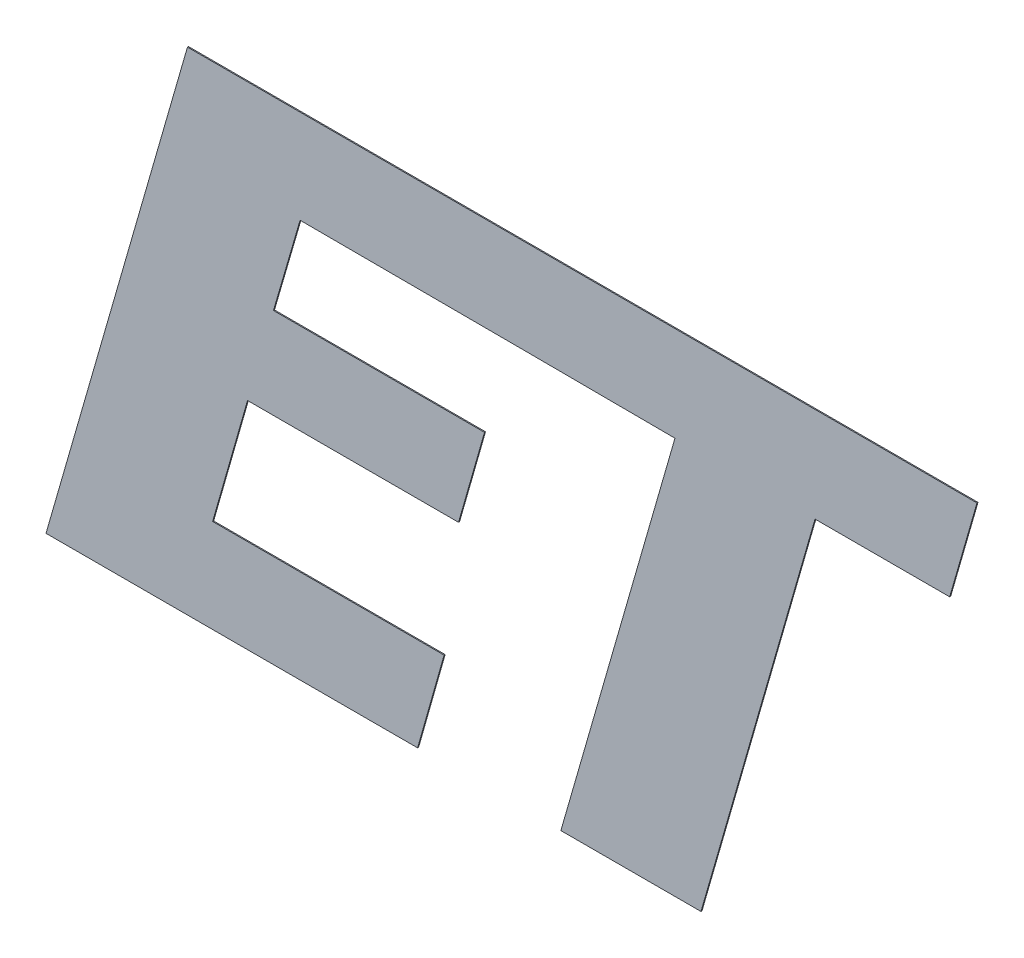
ISO-10303-21;
HEADER;
FILE_DESCRIPTION(('STEP AP214'),'2;1');
FILE_NAME('part.step','',(''),(''),'','','');
FILE_SCHEMA(('AUTOMOTIVE_DESIGN { 1 0 10303 214 1 1 1 1 }'));
ENDSEC;
DATA;
#1=APPLICATION_CONTEXT('core data for automotive mechanical design processes');
#2=APPLICATION_PROTOCOL_DEFINITION('international standard','automotive_design',2000,#1);
#3=PRODUCT_CONTEXT('',#1,'mechanical');
#4=PRODUCT('Part','Part','',(#3));
#5=PRODUCT_RELATED_PRODUCT_CATEGORY('part','',(#4));
#6=PRODUCT_DEFINITION_FORMATION('','',#4);
#7=PRODUCT_DEFINITION_CONTEXT('part definition',#1,'design');
#8=PRODUCT_DEFINITION('design','',#6,#7);
#9=PRODUCT_DEFINITION_SHAPE('','',#8);
#10=(LENGTH_UNIT() NAMED_UNIT(*) SI_UNIT(.MILLI.,.METRE.));
#11=(NAMED_UNIT(*) PLANE_ANGLE_UNIT() SI_UNIT($,.RADIAN.));
#12=(NAMED_UNIT(*) SI_UNIT($,.STERADIAN.) SOLID_ANGLE_UNIT());
#13=UNCERTAINTY_MEASURE_WITH_UNIT(LENGTH_MEASURE(1.E-05),#10,'distance_accuracy_value','');
#14=(GEOMETRIC_REPRESENTATION_CONTEXT(3) GLOBAL_UNCERTAINTY_ASSIGNED_CONTEXT((#13)) GLOBAL_UNIT_ASSIGNED_CONTEXT((#10,
#11,#12)) REPRESENTATION_CONTEXT('',''));
#15=CARTESIAN_POINT('',(0.,0.,0.));
#16=DIRECTION('',(0.,0.,1.));
#17=DIRECTION('',(1.,0.,0.));
#18=AXIS2_PLACEMENT_3D('',#15,#16,#17);
#19=CARTESIAN_POINT('',(11.8438200911148,6.48178370243124,5.505));
#20=DIRECTION('',(0.00281330167602319,0.99999604265901,0.));
#21=DIRECTION('',(0.,0.,-1.));
#22=AXIS2_PLACEMENT_3D('',#19,#20,#21);
#23=PLANE('',#22);
#24=DIRECTION('',(0.99999604265901,-0.00281330167602319,0.));
#25=VECTOR('',#24,1.);
#26=CARTESIAN_POINT('',(11.8438200911148,6.48178370243124,5.5));
#27=LINE('',#26,#25);
#28=CARTESIAN_POINT('',(11.8438200911148,6.48178370243124,5.5));
#29=VERTEX_POINT('',#28);
#30=CARTESIAN_POINT('',(12.952515059986,6.47866459667375,5.5));
#31=VERTEX_POINT('',#30);
#32=EDGE_CURVE('E10',#29,#31,#27,.T.);
#33=ORIENTED_EDGE('',*,*,#32,.T.);
#34=DIRECTION('',(0.,0.,-1.));
#35=VECTOR('',#34,1.);
#36=CARTESIAN_POINT('',(12.952515059986,6.47866459667375,5.505));
#37=LINE('',#36,#35);
#38=CARTESIAN_POINT('',(12.952515059986,6.47866459667375,5.505));
#39=VERTEX_POINT('',#38);
#40=EDGE_CURVE('E42',#39,#31,#37,.T.);
#41=ORIENTED_EDGE('',*,*,#40,.F.);
#42=DIRECTION('',(0.99999604265901,-0.00281330167602319,0.));
#43=VECTOR('',#42,1.);
#44=CARTESIAN_POINT('',(11.8438200911148,6.48178370243124,5.505));
#45=LINE('',#44,#43);
#46=CARTESIAN_POINT('',(11.8438200911148,6.48178370243124,5.505));
#47=VERTEX_POINT('',#46);
#48=EDGE_CURVE('E261',#47,#39,#45,.T.);
#49=ORIENTED_EDGE('',*,*,#48,.F.);
#50=DIRECTION('',(0.,0.,-1.));
#51=VECTOR('',#50,1.);
#52=CARTESIAN_POINT('',(11.8438200911148,6.48178370243124,5.505));
#53=LINE('',#52,#51);
#54=EDGE_CURVE('E27',#47,#29,#53,.T.);
#55=ORIENTED_EDGE('',*,*,#54,.T.);
#56=EDGE_LOOP('',(#33,#41,#49,#55));
#57=FACE_BOUND('',#56,.T.);
#58=ADVANCED_FACE('F16',(#57),#23,.F.);
#59=CARTESIAN_POINT('',(12.952515059986,6.47866459667375,5.505));
#60=DIRECTION('',(0.00465069382367867,0.999989185465002,0.));
#61=DIRECTION('',(0.,0.,-1.));
#62=AXIS2_PLACEMENT_3D('',#59,#60,#61);
#63=PLANE('',#62);
#64=DIRECTION('',(0.999989185465002,-0.00465069382367867,0.));
#65=VECTOR('',#64,1.);
#66=CARTESIAN_POINT('',(12.952515059986,6.47866459667375,5.5));
#67=LINE('',#66,#65);
#68=CARTESIAN_POINT('',(13.6880355080419,6.47524387927532,5.5));
#69=VERTEX_POINT('',#68);
#70=EDGE_CURVE('E322',#31,#69,#67,.T.);
#71=ORIENTED_EDGE('',*,*,#70,.T.);
#72=DIRECTION('',(0.,0.,-1.));
#73=VECTOR('',#72,1.);
#74=CARTESIAN_POINT('',(13.6880355080419,6.47524387927532,5.505));
#75=LINE('',#74,#73);
#76=CARTESIAN_POINT('',(13.6880355080419,6.47524387927532,5.505));
#77=VERTEX_POINT('',#76);
#78=EDGE_CURVE('E247',#77,#69,#75,.T.);
#79=ORIENTED_EDGE('',*,*,#78,.F.);
#80=DIRECTION('',(0.999989185465002,-0.00465069382367867,0.));
#81=VECTOR('',#80,1.);
#82=CARTESIAN_POINT('',(12.952515059986,6.47866459667375,5.505));
#83=LINE('',#82,#81);
#84=EDGE_CURVE('E243',#39,#77,#83,.T.);
#85=ORIENTED_EDGE('',*,*,#84,.F.);
#86=ORIENTED_EDGE('',*,*,#40,.T.);
#87=EDGE_LOOP('',(#71,#79,#85,#86));
#88=FACE_BOUND('',#87,.T.);
#89=ADVANCED_FACE('F420',(#88),#63,.F.);
#90=CARTESIAN_POINT('',(13.6880355080419,6.47524387927532,5.505));
#91=DIRECTION('',(0.961066454899892,-0.276317334356991,0.));
#92=DIRECTION('',(0.,0.,-1.));
#93=AXIS2_PLACEMENT_3D('',#90,#91,#92);
#94=PLANE('',#93);
#95=DIRECTION('',(-0.276317334356992,-0.961066454899892,0.));
#96=VECTOR('',#95,1.);
#97=CARTESIAN_POINT('',(13.6880355080419,6.47524387927532,5.5));
#98=LINE('',#97,#96);
#99=CARTESIAN_POINT('',(13.126743599469,4.52299999999993,5.5));
#100=VERTEX_POINT('',#99);
#101=EDGE_CURVE('E272',#69,#100,#98,.T.);
#102=ORIENTED_EDGE('',*,*,#101,.T.);
#103=DIRECTION('',(0.,0.,-1.));
#104=VECTOR('',#103,1.);
#105=CARTESIAN_POINT('',(13.126743599469,4.52299999999993,5.505));
#106=LINE('',#105,#104);
#107=CARTESIAN_POINT('',(13.126743599469,4.52299999999993,5.505));
#108=VERTEX_POINT('',#107);
#109=EDGE_CURVE('E92',#108,#100,#106,.T.);
#110=ORIENTED_EDGE('',*,*,#109,.F.);
#111=DIRECTION('',(-0.276317334356992,-0.961066454899892,0.));
#112=VECTOR('',#111,1.);
#113=CARTESIAN_POINT('',(13.6880355080419,6.47524387927532,5.505));
#114=LINE('',#113,#112);
#115=EDGE_CURVE('E108',#77,#108,#114,.T.);
#116=ORIENTED_EDGE('',*,*,#115,.F.);
#117=ORIENTED_EDGE('',*,*,#78,.T.);
#118=EDGE_LOOP('',(#102,#110,#116,#117));
#119=FACE_BOUND('',#118,.T.);
#120=ADVANCED_FACE('F422',(#119),#94,.F.);
#121=CARTESIAN_POINT('',(13.126743599469,4.52299999999993,5.505));
#122=DIRECTION('',(0.,1.,0.));
#123=DIRECTION('',(1.,0.,0.));
#124=AXIS2_PLACEMENT_3D('',#121,#122,#123);
#125=PLANE('',#124);
#126=DIRECTION('',(1.,0.,0.));
#127=VECTOR('',#126,1.);
#128=CARTESIAN_POINT('',(13.126743599469,4.52299999999993,5.5));
#129=LINE('',#128,#127);
#130=CARTESIAN_POINT('',(13.8159335568288,4.52299999999993,5.5));
#131=VERTEX_POINT('',#130);
#132=EDGE_CURVE('E244',#100,#131,#129,.T.);
#133=ORIENTED_EDGE('',*,*,#132,.T.);
#134=DIRECTION('',(0.,0.,-1.));
#135=VECTOR('',#134,1.);
#136=CARTESIAN_POINT('',(13.8159335568288,4.52299999999993,5.505));
#137=LINE('',#136,#135);
#138=CARTESIAN_POINT('',(13.8159335568288,4.52299999999993,5.505));
#139=VERTEX_POINT('',#138);
#140=EDGE_CURVE('E254',#139,#131,#137,.T.);
#141=ORIENTED_EDGE('',*,*,#140,.F.);
#142=DIRECTION('',(1.,0.,0.));
#143=VECTOR('',#142,1.);
#144=CARTESIAN_POINT('',(13.126743599469,4.52299999999993,5.505));
#145=LINE('',#144,#143);
#146=EDGE_CURVE('E235',#108,#139,#145,.T.);
#147=ORIENTED_EDGE('',*,*,#146,.F.);
#148=ORIENTED_EDGE('',*,*,#109,.T.);
#149=EDGE_LOOP('',(#133,#141,#147,#148));
#150=FACE_BOUND('',#149,.T.);
#151=ADVANCED_FACE('F423',(#150),#125,.F.);
#152=CARTESIAN_POINT('',(13.8159335568288,4.52299999999993,5.505));
#153=DIRECTION('',(-0.961087610217279,0.276243742891742,0.));
#154=DIRECTION('',(0.,0.,1.));
#155=AXIS2_PLACEMENT_3D('',#152,#153,#154);
#156=PLANE('',#155);
#157=DIRECTION('',(0.276243742891742,0.961087610217279,0.));
#158=VECTOR('',#157,1.);
#159=CARTESIAN_POINT('',(13.8159335568288,4.52299999999993,5.5));
#160=LINE('',#159,#158);
#161=CARTESIAN_POINT('',(14.3770636250074,6.47524387926913,5.5));
#162=VERTEX_POINT('',#161);
#163=EDGE_CURVE('E257',#131,#162,#160,.T.);
#164=ORIENTED_EDGE('',*,*,#163,.T.);
#165=DIRECTION('',(0.,0.,-1.));
#166=VECTOR('',#165,1.);
#167=CARTESIAN_POINT('',(14.3770636250074,6.47524387926913,5.505));
#168=LINE('',#167,#166);
#169=CARTESIAN_POINT('',(14.3770636250074,6.47524387926913,5.505));
#170=VERTEX_POINT('',#169);
#171=EDGE_CURVE('E341',#170,#162,#168,.T.);
#172=ORIENTED_EDGE('',*,*,#171,.F.);
#173=DIRECTION('',(0.276243742891742,0.961087610217279,0.));
#174=VECTOR('',#173,1.);
#175=CARTESIAN_POINT('',(13.8159335568288,4.52299999999993,5.505));
#176=LINE('',#175,#174);
#177=EDGE_CURVE('E238',#139,#170,#176,.T.);
#178=ORIENTED_EDGE('',*,*,#177,.F.);
#179=ORIENTED_EDGE('',*,*,#140,.T.);
#180=EDGE_LOOP('',(#164,#172,#178,#179));
#181=FACE_BOUND('',#180,.T.);
#182=ADVANCED_FACE('F400',(#181),#156,.F.);
#183=CARTESIAN_POINT('',(14.3770636250074,6.47524387926913,5.505));
#184=DIRECTION('',(7.9388471098131E-05,0.999999996848735,0.));
#185=DIRECTION('',(0.,0.,-1.));
#186=AXIS2_PLACEMENT_3D('',#183,#184,#185);
#187=PLANE('',#186);
#188=DIRECTION('',(0.999999996848735,-7.9388471098131E-05,0.));
#189=VECTOR('',#188,1.);
#190=CARTESIAN_POINT('',(14.3770636250074,6.47524387926913,5.5));
#191=LINE('',#190,#189);
#192=CARTESIAN_POINT('',(15.039467941804,6.47519129200301,5.5));
#193=VERTEX_POINT('',#192);
#194=EDGE_CURVE('E258',#162,#193,#191,.T.);
#195=ORIENTED_EDGE('',*,*,#194,.T.);
#196=DIRECTION('',(0.,0.,-1.));
#197=VECTOR('',#196,1.);
#198=CARTESIAN_POINT('',(15.039467941804,6.47519129200301,5.505));
#199=LINE('',#198,#197);
#200=CARTESIAN_POINT('',(15.039467941804,6.47519129200301,5.505));
#201=VERTEX_POINT('',#200);
#202=EDGE_CURVE('E231',#201,#193,#199,.T.);
#203=ORIENTED_EDGE('',*,*,#202,.F.);
#204=DIRECTION('',(0.999999996848735,-7.9388471098131E-05,0.));
#205=VECTOR('',#204,1.);
#206=CARTESIAN_POINT('',(14.3770636250074,6.47524387926913,5.505));
#207=LINE('',#206,#205);
#208=EDGE_CURVE('E199',#170,#201,#207,.T.);
#209=ORIENTED_EDGE('',*,*,#208,.F.);
#210=ORIENTED_EDGE('',*,*,#171,.T.);
#211=EDGE_LOOP('',(#195,#203,#209,#210));
#212=FACE_BOUND('',#211,.T.);
#213=ADVANCED_FACE('F405',(#212),#187,.F.);
#214=CARTESIAN_POINT('',(15.039467941804,6.47519129200301,5.505));
#215=DIRECTION('',(-0.961099233430554,0.276203301028793,0.));
#216=DIRECTION('',(0.,0.,1.));
#217=AXIS2_PLACEMENT_3D('',#214,#215,#216);
#218=PLANE('',#217);
#219=DIRECTION('',(0.276203301028793,0.961099233430554,0.));
#220=VECTOR('',#219,1.);
#221=CARTESIAN_POINT('',(15.039467941804,6.47519129200301,5.5));
#222=LINE('',#221,#220);
#223=CARTESIAN_POINT('',(15.1737303180499,6.94238146101224,5.5));
#224=VERTEX_POINT('',#223);
#225=EDGE_CURVE('E208',#193,#224,#222,.T.);
#226=ORIENTED_EDGE('',*,*,#225,.T.);
#227=DIRECTION('',(0.,0.,-1.));
#228=VECTOR('',#227,1.);
#229=CARTESIAN_POINT('',(15.1737303180499,6.94238146101224,5.505));
#230=LINE('',#229,#228);
#231=CARTESIAN_POINT('',(15.1737303180499,6.94238146101224,5.505));
#232=VERTEX_POINT('',#231);
#233=EDGE_CURVE('E205',#232,#224,#230,.T.);
#234=ORIENTED_EDGE('',*,*,#233,.F.);
#235=DIRECTION('',(0.276203301028793,0.961099233430554,0.));
#236=VECTOR('',#235,1.);
#237=CARTESIAN_POINT('',(15.039467941804,6.47519129200301,5.505));
#238=LINE('',#237,#236);
#239=EDGE_CURVE('E193',#201,#232,#238,.T.);
#240=ORIENTED_EDGE('',*,*,#239,.F.);
#241=ORIENTED_EDGE('',*,*,#202,.T.);
#242=EDGE_LOOP('',(#226,#234,#240,#241));
#243=FACE_BOUND('',#242,.T.);
#244=ADVANCED_FACE('F206',(#243),#218,.F.);
#245=CARTESIAN_POINT('',(13.0859009713149,6.94238146101224,5.505));
#246=DIRECTION('',(0.,-1.,0.));
#247=DIRECTION('',(0.,0.,-1.));
#248=AXIS2_PLACEMENT_3D('',#245,#246,#247);
#249=PLANE('',#248);
#250=DIRECTION('',(-1.,0.,0.));
#251=VECTOR('',#250,1.);
#252=CARTESIAN_POINT('',(13.0859009713149,6.94238146101224,5.5));
#253=LINE('',#252,#251);
#254=CARTESIAN_POINT('',(11.2898551404599,6.94238146101224,5.5));
#255=VERTEX_POINT('',#254);
#256=EDGE_CURVE('E212',#224,#255,#253,.T.);
#257=ORIENTED_EDGE('',*,*,#256,.T.);
#258=DIRECTION('',(0.,0.,-1.));
#259=VECTOR('',#258,1.);
#260=CARTESIAN_POINT('',(11.2898551404599,6.94238146101224,5.505));
#261=LINE('',#260,#259);
#262=CARTESIAN_POINT('',(11.2898551404599,6.94238146101224,5.505));
#263=VERTEX_POINT('',#262);
#264=EDGE_CURVE('E185',#263,#255,#261,.T.);
#265=ORIENTED_EDGE('',*,*,#264,.F.);
#266=DIRECTION('',(-1.,0.,0.));
#267=VECTOR('',#266,1.);
#268=CARTESIAN_POINT('',(15.1737303180499,6.94238146101224,5.505));
#269=LINE('',#268,#267);
#270=EDGE_CURVE('E197',#232,#263,#269,.T.);
#271=ORIENTED_EDGE('',*,*,#270,.F.);
#272=ORIENTED_EDGE('',*,*,#233,.T.);
#273=EDGE_LOOP('',(#257,#265,#271,#272));
#274=FACE_BOUND('',#273,.T.);
#275=ADVANCED_FACE('F215',(#274),#249,.F.);
#276=CARTESIAN_POINT('',(11.2898551404599,6.94238146101224,5.505));
#277=DIRECTION('',(0.961034823670663,-0.276427328048978,0.));
#278=DIRECTION('',(0.,0.,-1.));
#279=AXIS2_PLACEMENT_3D('',#276,#277,#278);
#280=PLANE('',#279);
#281=DIRECTION('',(-0.276427328048978,-0.961034823670663,0.));
#282=VECTOR('',#281,1.);
#283=CARTESIAN_POINT('',(11.2898551404599,6.94238146101224,5.5));
#284=LINE('',#283,#282);
#285=CARTESIAN_POINT('',(10.5939561612279,4.52299999999993,5.5));
#286=VERTEX_POINT('',#285);
#287=EDGE_CURVE('E213',#255,#286,#284,.T.);
#288=ORIENTED_EDGE('',*,*,#287,.T.);
#289=DIRECTION('',(0.,0.,-1.));
#290=VECTOR('',#289,1.);
#291=CARTESIAN_POINT('',(10.5939561612279,4.52299999999993,5.505));
#292=LINE('',#291,#290);
#293=CARTESIAN_POINT('',(10.5939561612279,4.52299999999993,5.505));
#294=VERTEX_POINT('',#293);
#295=EDGE_CURVE('E252',#294,#286,#292,.T.);
#296=ORIENTED_EDGE('',*,*,#295,.F.);
#297=DIRECTION('',(-0.276427328048978,-0.961034823670663,0.));
#298=VECTOR('',#297,1.);
#299=CARTESIAN_POINT('',(11.2898551404599,6.94238146101224,5.505));
#300=LINE('',#299,#298);
#301=EDGE_CURVE('E217',#263,#294,#300,.T.);
#302=ORIENTED_EDGE('',*,*,#301,.F.);
#303=ORIENTED_EDGE('',*,*,#264,.T.);
#304=EDGE_LOOP('',(#288,#296,#302,#303));
#305=FACE_BOUND('',#304,.T.);
#306=ADVANCED_FACE('F503',(#305),#280,.F.);
#307=CARTESIAN_POINT('',(10.5939561612279,4.52299999999993,5.505));
#308=DIRECTION('',(0.,1.,0.));
#309=DIRECTION('',(1.,0.,0.));
#310=AXIS2_PLACEMENT_3D('',#307,#308,#309);
#311=PLANE('',#310);
#312=DIRECTION('',(1.,0.,0.));
#313=VECTOR('',#312,1.);
#314=CARTESIAN_POINT('',(10.5939561612279,4.52299999999993,5.5));
#315=LINE('',#314,#313);
#316=CARTESIAN_POINT('',(12.4218698367478,4.52299999999993,5.5));
#317=VERTEX_POINT('',#316);
#318=EDGE_CURVE('E316',#286,#317,#315,.T.);
#319=ORIENTED_EDGE('',*,*,#318,.T.);
#320=DIRECTION('',(0.,0.,-1.));
#321=VECTOR('',#320,1.);
#322=CARTESIAN_POINT('',(12.4218698367478,4.52299999999993,5.505));
#323=LINE('',#322,#321);
#324=CARTESIAN_POINT('',(12.4218698367478,4.52299999999993,5.505));
#325=VERTEX_POINT('',#324);
#326=EDGE_CURVE('E253',#325,#317,#323,.T.);
#327=ORIENTED_EDGE('',*,*,#326,.F.);
#328=DIRECTION('',(1.,0.,0.));
#329=VECTOR('',#328,1.);
#330=CARTESIAN_POINT('',(10.5939561612279,4.52299999999993,5.505));
#331=LINE('',#330,#329);
#332=EDGE_CURVE('E224',#294,#325,#331,.T.);
#333=ORIENTED_EDGE('',*,*,#332,.F.);
#334=ORIENTED_EDGE('',*,*,#295,.T.);
#335=EDGE_LOOP('',(#319,#327,#333,#334));
#336=FACE_BOUND('',#335,.T.);
#337=ADVANCED_FACE('F441',(#336),#311,.F.);
#338=CARTESIAN_POINT('',(12.4218698367478,4.52299999999993,5.505));
#339=DIRECTION('',(-0.962020079379862,0.272978693069558,0.));
#340=DIRECTION('',(0.,0.,1.));
#341=AXIS2_PLACEMENT_3D('',#338,#339,#340);
#342=PLANE('',#341);
#343=DIRECTION('',(0.272978693069558,0.962020079379862,0.));
#344=VECTOR('',#343,1.);
#345=CARTESIAN_POINT('',(12.4218698367478,4.52299999999993,5.5));
#346=LINE('',#345,#344);
#347=CARTESIAN_POINT('',(12.5525044594531,4.98337706713127,5.5));
#348=VERTEX_POINT('',#347);
#349=EDGE_CURVE('E248',#317,#348,#346,.T.);
#350=ORIENTED_EDGE('',*,*,#349,.T.);
#351=DIRECTION('',(0.,0.,-1.));
#352=VECTOR('',#351,1.);
#353=CARTESIAN_POINT('',(12.5525044594531,4.98337706713127,5.505));
#354=LINE('',#353,#352);
#355=CARTESIAN_POINT('',(12.5525044594531,4.98337706713127,5.505));
#356=VERTEX_POINT('',#355);
#357=EDGE_CURVE('E275',#356,#348,#354,.T.);
#358=ORIENTED_EDGE('',*,*,#357,.F.);
#359=DIRECTION('',(0.272978693069558,0.962020079379862,0.));
#360=VECTOR('',#359,1.);
#361=CARTESIAN_POINT('',(12.4218698367478,4.52299999999993,5.505));
#362=LINE('',#361,#360);
#363=EDGE_CURVE('E234',#325,#356,#362,.T.);
#364=ORIENTED_EDGE('',*,*,#363,.F.);
#365=ORIENTED_EDGE('',*,*,#326,.T.);
#366=EDGE_LOOP('',(#350,#358,#364,#365));
#367=FACE_BOUND('',#366,.T.);
#368=ADVANCED_FACE('F488',(#367),#342,.F.);
#369=CARTESIAN_POINT('',(12.5525044594531,4.98337706713127,5.505));
#370=DIRECTION('',(0.,-1.,0.));
#371=DIRECTION('',(0.,0.,-1.));
#372=AXIS2_PLACEMENT_3D('',#369,#370,#371);
#373=PLANE('',#372);
#374=DIRECTION('',(-1.,0.,0.));
#375=VECTOR('',#374,1.);
#376=CARTESIAN_POINT('',(12.5525044594531,4.98337706713127,5.5));
#377=LINE('',#376,#375);
#378=CARTESIAN_POINT('',(11.4136336136633,4.98337706713127,5.5));
#379=VERTEX_POINT('',#378);
#380=EDGE_CURVE('E228',#348,#379,#377,.T.);
#381=ORIENTED_EDGE('',*,*,#380,.T.);
#382=DIRECTION('',(0.,0.,-1.));
#383=VECTOR('',#382,1.);
#384=CARTESIAN_POINT('',(11.4136336136633,4.98337706713127,5.505));
#385=LINE('',#384,#383);
#386=CARTESIAN_POINT('',(11.4136336136633,4.98337706713127,5.505));
#387=VERTEX_POINT('',#386);
#388=EDGE_CURVE('E343',#387,#379,#385,.T.);
#389=ORIENTED_EDGE('',*,*,#388,.F.);
#390=DIRECTION('',(-1.,0.,0.));
#391=VECTOR('',#390,1.);
#392=CARTESIAN_POINT('',(12.5525044594531,4.98337706713127,5.505));
#393=LINE('',#392,#391);
#394=EDGE_CURVE('E308',#356,#387,#393,.T.);
#395=ORIENTED_EDGE('',*,*,#394,.F.);
#396=ORIENTED_EDGE('',*,*,#357,.T.);
#397=EDGE_LOOP('',(#381,#389,#395,#396));
#398=FACE_BOUND('',#397,.T.);
#399=ADVANCED_FACE('F481',(#398),#373,.F.);
#400=CARTESIAN_POINT('',(11.4136336136633,4.98337706713127,5.505));
#401=DIRECTION('',(-0.961582531986914,0.274515999857269,0.));
#402=DIRECTION('',(0.,0.,1.));
#403=AXIS2_PLACEMENT_3D('',#400,#401,#402);
#404=PLANE('',#403);
#405=DIRECTION('',(0.274515999857269,0.961582531986914,0.));
#406=VECTOR('',#405,1.);
#407=CARTESIAN_POINT('',(11.4136336136633,4.98337706713127,5.5));
#408=LINE('',#407,#406);
#409=CARTESIAN_POINT('',(11.585272706859,5.58459941449501,5.5));
#410=VERTEX_POINT('',#409);
#411=EDGE_CURVE('E278',#379,#410,#408,.T.);
#412=ORIENTED_EDGE('',*,*,#411,.T.);
#413=DIRECTION('',(0.,0.,-1.));
#414=VECTOR('',#413,1.);
#415=CARTESIAN_POINT('',(11.585272706859,5.58459941449501,5.505));
#416=LINE('',#415,#414);
#417=CARTESIAN_POINT('',(11.585272706859,5.58459941449501,5.505));
#418=VERTEX_POINT('',#417);
#419=EDGE_CURVE('E323',#418,#410,#416,.T.);
#420=ORIENTED_EDGE('',*,*,#419,.F.);
#421=DIRECTION('',(0.274515999857269,0.961582531986914,0.));
#422=VECTOR('',#421,1.);
#423=CARTESIAN_POINT('',(11.4136336136633,4.98337706713127,5.505));
#424=LINE('',#423,#422);
#425=EDGE_CURVE('E268',#387,#418,#424,.T.);
#426=ORIENTED_EDGE('',*,*,#425,.F.);
#427=ORIENTED_EDGE('',*,*,#388,.T.);
#428=EDGE_LOOP('',(#412,#420,#426,#427));
#429=FACE_BOUND('',#428,.T.);
#430=ADVANCED_FACE('F474',(#429),#404,.F.);
#431=CARTESIAN_POINT('',(11.585272706859,5.58459941449501,5.505));
#432=DIRECTION('',(0.,1.,0.));
#433=DIRECTION('',(1.,0.,0.));
#434=AXIS2_PLACEMENT_3D('',#431,#432,#433);
#435=PLANE('',#434);
#436=DIRECTION('',(1.,0.,0.));
#437=VECTOR('',#436,1.);
#438=CARTESIAN_POINT('',(11.585272706859,5.58459941449501,5.5));
#439=LINE('',#438,#437);
#440=CARTESIAN_POINT('',(12.6233905516032,5.58459941449501,5.5));
#441=VERTEX_POINT('',#440);
#442=EDGE_CURVE('E20',#410,#441,#439,.T.);
#443=ORIENTED_EDGE('',*,*,#442,.T.);
#444=DIRECTION('',(0.,0.,-1.));
#445=VECTOR('',#444,1.);
#446=CARTESIAN_POINT('',(12.6233905516032,5.58459941449501,5.505));
#447=LINE('',#446,#445);
#448=CARTESIAN_POINT('',(12.6233905516032,5.58459941449501,5.505));
#449=VERTEX_POINT('',#448);
#450=EDGE_CURVE('E282',#449,#441,#447,.T.);
#451=ORIENTED_EDGE('',*,*,#450,.F.);
#452=DIRECTION('',(1.,0.,0.));
#453=VECTOR('',#452,1.);
#454=CARTESIAN_POINT('',(11.585272706859,5.58459941449501,5.505));
#455=LINE('',#454,#453);
#456=EDGE_CURVE('E266',#418,#449,#455,.T.);
#457=ORIENTED_EDGE('',*,*,#456,.F.);
#458=ORIENTED_EDGE('',*,*,#419,.T.);
#459=EDGE_LOOP('',(#443,#451,#457,#458));
#460=FACE_BOUND('',#459,.T.);
#461=ADVANCED_FACE('F363',(#460),#435,.F.);
#462=CARTESIAN_POINT('',(12.6233905516032,5.58459941449501,5.505));
#463=DIRECTION('',(-0.961532303768429,0.274691879766725,0.));
#464=DIRECTION('',(0.,0.,1.));
#465=AXIS2_PLACEMENT_3D('',#462,#463,#464);
#466=PLANE('',#465);
#467=DIRECTION('',(0.274691879766725,0.961532303768429,0.));
#468=VECTOR('',#467,1.);
#469=CARTESIAN_POINT('',(12.6233905516032,5.58459941449501,5.5));
#470=LINE('',#469,#468);
#471=CARTESIAN_POINT('',(12.7511414727603,6.03177913321493,5.5));
#472=VERTEX_POINT('',#471);
#473=EDGE_CURVE('E312',#441,#472,#470,.T.);
#474=ORIENTED_EDGE('',*,*,#473,.T.);
#475=DIRECTION('',(0.,0.,-1.));
#476=VECTOR('',#475,1.);
#477=CARTESIAN_POINT('',(12.7511414727603,6.03177913321493,5.505));
#478=LINE('',#477,#476);
#479=CARTESIAN_POINT('',(12.7511414727603,6.03177913321493,5.505));
#480=VERTEX_POINT('',#479);
#481=EDGE_CURVE('E141',#480,#472,#478,.T.);
#482=ORIENTED_EDGE('',*,*,#481,.F.);
#483=DIRECTION('',(0.274691879766725,0.961532303768429,0.));
#484=VECTOR('',#483,1.);
#485=CARTESIAN_POINT('',(12.6233905516032,5.58459941449501,5.505));
#486=LINE('',#485,#484);
#487=EDGE_CURVE('E155',#449,#480,#486,.T.);
#488=ORIENTED_EDGE('',*,*,#487,.F.);
#489=ORIENTED_EDGE('',*,*,#450,.T.);
#490=EDGE_LOOP('',(#474,#482,#488,#489));
#491=FACE_BOUND('',#490,.T.);
#492=ADVANCED_FACE('F446',(#491),#466,.F.);
#493=CARTESIAN_POINT('',(12.7511414727603,6.03177913321493,5.505));
#494=DIRECTION('',(0.,-1.,0.));
#495=DIRECTION('',(0.,0.,-1.));
#496=AXIS2_PLACEMENT_3D('',#493,#494,#495);
#497=PLANE('',#496);
#498=DIRECTION('',(-1.,0.,0.));
#499=VECTOR('',#498,1.);
#500=CARTESIAN_POINT('',(12.7511414727603,6.03177913321493,5.5));
#501=LINE('',#500,#499);
#502=CARTESIAN_POINT('',(11.7128765003861,6.03177913321493,5.5));
#503=VERTEX_POINT('',#502);
#504=EDGE_CURVE('E279',#472,#503,#501,.T.);
#505=ORIENTED_EDGE('',*,*,#504,.T.);
#506=DIRECTION('',(0.,0.,-1.));
#507=VECTOR('',#506,1.);
#508=CARTESIAN_POINT('',(11.7128765003861,6.03177913321493,5.505));
#509=LINE('',#508,#507);
#510=CARTESIAN_POINT('',(11.7128765003861,6.03177913321493,5.505));
#511=VERTEX_POINT('',#510);
#512=EDGE_CURVE('E287',#511,#503,#509,.T.);
#513=ORIENTED_EDGE('',*,*,#512,.F.);
#514=DIRECTION('',(-1.,0.,0.));
#515=VECTOR('',#514,1.);
#516=CARTESIAN_POINT('',(12.7511414727603,6.03177913321493,5.505));
#517=LINE('',#516,#515);
#518=EDGE_CURVE('E262',#480,#511,#517,.T.);
#519=ORIENTED_EDGE('',*,*,#518,.F.);
#520=ORIENTED_EDGE('',*,*,#481,.T.);
#521=EDGE_LOOP('',(#505,#513,#519,#520));
#522=FACE_BOUND('',#521,.T.);
#523=ADVANCED_FACE('F416',(#522),#497,.F.);
#524=CARTESIAN_POINT('',(11.7128765003861,6.03177913321493,5.505));
#525=DIRECTION('',(-0.960176311434604,0.279394794081491,0.));
#526=DIRECTION('',(0.,0.,1.));
#527=AXIS2_PLACEMENT_3D('',#524,#525,#526);
#528=PLANE('',#527);
#529=DIRECTION('',(0.279394794081491,0.960176311434604,0.));
#530=VECTOR('',#529,1.);
#531=CARTESIAN_POINT('',(11.7128765003861,6.03177913321493,5.5));
#532=LINE('',#531,#530);
#533=EDGE_CURVE('E284',#503,#29,#532,.T.);
#534=ORIENTED_EDGE('',*,*,#533,.T.);
#535=ORIENTED_EDGE('',*,*,#54,.F.);
#536=DIRECTION('',(0.279394794081491,0.960176311434604,0.));
#537=VECTOR('',#536,1.);
#538=CARTESIAN_POINT('',(11.7128765003861,6.03177913321493,5.505));
#539=LINE('',#538,#537);
#540=EDGE_CURVE('E265',#511,#47,#539,.T.);
#541=ORIENTED_EDGE('',*,*,#540,.F.);
#542=ORIENTED_EDGE('',*,*,#512,.T.);
#543=EDGE_LOOP('',(#534,#535,#541,#542));
#544=FACE_BOUND('',#543,.T.);
#545=ADVANCED_FACE('F18',(#544),#528,.F.);
#546=CARTESIAN_POINT('',(0.0817044061757538,-8.90197282742609,5.505));
#547=DIRECTION('',(0.,0.,1.));
#548=DIRECTION('',(1.,0.,0.));
#549=AXIS2_PLACEMENT_3D('',#546,#547,#548);
#550=PLANE('',#549);
#551=ORIENTED_EDGE('',*,*,#48,.T.);
#552=ORIENTED_EDGE('',*,*,#84,.T.);
#553=ORIENTED_EDGE('',*,*,#115,.T.);
#554=ORIENTED_EDGE('',*,*,#146,.T.);
#555=ORIENTED_EDGE('',*,*,#177,.T.);
#556=ORIENTED_EDGE('',*,*,#208,.T.);
#557=ORIENTED_EDGE('',*,*,#239,.T.);
#558=ORIENTED_EDGE('',*,*,#270,.T.);
#559=ORIENTED_EDGE('',*,*,#301,.T.);
#560=ORIENTED_EDGE('',*,*,#332,.T.);
#561=ORIENTED_EDGE('',*,*,#363,.T.);
#562=ORIENTED_EDGE('',*,*,#394,.T.);
#563=ORIENTED_EDGE('',*,*,#425,.T.);
#564=ORIENTED_EDGE('',*,*,#456,.T.);
#565=ORIENTED_EDGE('',*,*,#487,.T.);
#566=ORIENTED_EDGE('',*,*,#518,.T.);
#567=ORIENTED_EDGE('',*,*,#540,.T.);
#568=EDGE_LOOP('',(#551,#552,#553,#554,#555,#556,#557,#558,#559,#560,#561,#562,#563,#564,#565,
#566,#567));
#569=FACE_BOUND('',#568,.T.);
#570=ADVANCED_FACE('F195',(#569),#550,.T.);
#571=CARTESIAN_POINT('',(0.0817044061757538,-8.90197282742609,5.5));
#572=DIRECTION('',(0.,0.,1.));
#573=DIRECTION('',(1.,0.,0.));
#574=AXIS2_PLACEMENT_3D('',#571,#572,#573);
#575=PLANE('',#574);
#576=ORIENTED_EDGE('',*,*,#32,.F.);
#577=ORIENTED_EDGE('',*,*,#533,.F.);
#578=ORIENTED_EDGE('',*,*,#504,.F.);
#579=ORIENTED_EDGE('',*,*,#473,.F.);
#580=ORIENTED_EDGE('',*,*,#442,.F.);
#581=ORIENTED_EDGE('',*,*,#411,.F.);
#582=ORIENTED_EDGE('',*,*,#380,.F.);
#583=ORIENTED_EDGE('',*,*,#349,.F.);
#584=ORIENTED_EDGE('',*,*,#318,.F.);
#585=ORIENTED_EDGE('',*,*,#287,.F.);
#586=ORIENTED_EDGE('',*,*,#256,.F.);
#587=ORIENTED_EDGE('',*,*,#225,.F.);
#588=ORIENTED_EDGE('',*,*,#194,.F.);
#589=ORIENTED_EDGE('',*,*,#163,.F.);
#590=ORIENTED_EDGE('',*,*,#132,.F.);
#591=ORIENTED_EDGE('',*,*,#101,.F.);
#592=ORIENTED_EDGE('',*,*,#70,.F.);
#593=EDGE_LOOP('',(#576,#577,#578,#579,#580,#581,#582,#583,#584,#585,#586,#587,#588,#589,#590,
#591,#592));
#594=FACE_BOUND('',#593,.T.);
#595=ADVANCED_FACE('F372',(#594),#575,.F.);
#596=CLOSED_SHELL('',(#58,#89,#120,#151,#182,#213,#244,#275,#306,#337,#368,#399,#430,#461,#492,
#523,#545,#570,#595));
#597=MANIFOLD_SOLID_BREP('B1',#596);
#598=ADVANCED_BREP_SHAPE_REPRESENTATION('',(#18,#597),#14);
#599=SHAPE_DEFINITION_REPRESENTATION(#9,#598);
ENDSEC;
END-ISO-10303-21;
